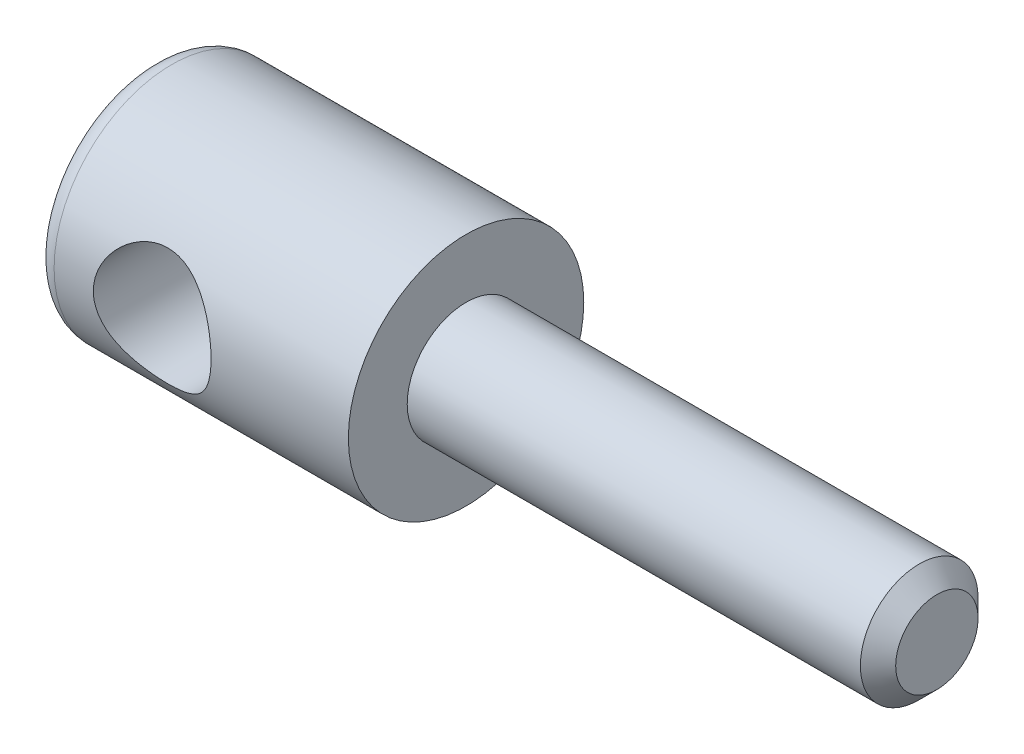
ISO-10303-21;
HEADER;
FILE_DESCRIPTION(('STEP AP214'),'2;1');
FILE_NAME('part.step','',(''),(''),'','','');
FILE_SCHEMA(('AUTOMOTIVE_DESIGN { 1 0 10303 214 1 1 1 1 }'));
ENDSEC;
DATA;
#1=APPLICATION_CONTEXT('core data for automotive mechanical design processes');
#2=APPLICATION_PROTOCOL_DEFINITION('international standard','automotive_design',2000,#1);
#3=PRODUCT_CONTEXT('',#1,'mechanical');
#4=PRODUCT('Part','Part','',(#3));
#5=PRODUCT_RELATED_PRODUCT_CATEGORY('part','',(#4));
#6=PRODUCT_DEFINITION_FORMATION('','',#4);
#7=PRODUCT_DEFINITION_CONTEXT('part definition',#1,'design');
#8=PRODUCT_DEFINITION('design','',#6,#7);
#9=PRODUCT_DEFINITION_SHAPE('','',#8);
#10=(LENGTH_UNIT() NAMED_UNIT(*) SI_UNIT(.MILLI.,.METRE.));
#11=(NAMED_UNIT(*) PLANE_ANGLE_UNIT() SI_UNIT($,.RADIAN.));
#12=(NAMED_UNIT(*) SI_UNIT($,.STERADIAN.) SOLID_ANGLE_UNIT());
#13=UNCERTAINTY_MEASURE_WITH_UNIT(LENGTH_MEASURE(1.E-05),#10,'distance_accuracy_value','');
#14=(GEOMETRIC_REPRESENTATION_CONTEXT(3) GLOBAL_UNCERTAINTY_ASSIGNED_CONTEXT((#13)) GLOBAL_UNIT_ASSIGNED_CONTEXT((#10,
#11,#12)) REPRESENTATION_CONTEXT('',''));
#15=CARTESIAN_POINT('',(0.,0.,0.));
#16=DIRECTION('',(0.,0.,1.));
#17=DIRECTION('',(1.,0.,0.));
#18=AXIS2_PLACEMENT_3D('',#15,#16,#17);
#19=CARTESIAN_POINT('',(0.,0.,0.));
#20=DIRECTION('',(1.,0.,0.));
#21=DIRECTION('',(0.,0.,-1.));
#22=AXIS2_PLACEMENT_3D('',#19,#20,#21);
#23=PLANE('',#22);
#24=CARTESIAN_POINT('',(0.,0.,0.));
#25=DIRECTION('',(1.,0.,0.));
#26=DIRECTION('',(0.,0.,-1.));
#27=AXIS2_PLACEMENT_3D('',#24,#25,#26);
#28=CIRCLE('',#27,7.9375);
#29=CARTESIAN_POINT('',(0.,0.,-7.9375));
#30=VERTEX_POINT('',#29);
#31=EDGE_CURVE('E79',#30,#30,#28,.F.);
#32=ORIENTED_EDGE('',*,*,#31,.T.);
#33=EDGE_LOOP('',(#32));
#34=FACE_BOUND('',#33,.T.);
#35=ADVANCED_FACE('F55',(#34),#23,.F.);
#36=CARTESIAN_POINT('',(0.,0.,0.));
#37=DIRECTION('',(-1.,0.,0.));
#38=DIRECTION('',(0.,0.,1.));
#39=AXIS2_PLACEMENT_3D('',#36,#37,#38);
#40=CYLINDRICAL_SURFACE('',#39,9.525);
#41=CARTESIAN_POINT('',(1.5875,0.,0.));
#42=DIRECTION('',(1.,0.,0.));
#43=DIRECTION('',(0.,0.,-1.));
#44=AXIS2_PLACEMENT_3D('',#41,#42,#43);
#45=CIRCLE('',#44,9.525);
#46=CARTESIAN_POINT('',(1.5875,0.,-9.525));
#47=VERTEX_POINT('',#46);
#48=EDGE_CURVE('E71',#47,#47,#45,.T.);
#49=ORIENTED_EDGE('',*,*,#48,.T.);
#50=EDGE_LOOP('',(#49));
#51=FACE_BOUND('',#50,.T.);
#52=CARTESIAN_POINT('',(14.2875,0.,-9.525));
#53=CARTESIAN_POINT('',(14.2874995883142,0.125243167799988,-9.52499962063721));
#54=CARTESIAN_POINT('',(14.2825538815409,0.250495089131834,-9.52252400598023));
#55=CARTESIAN_POINT('',(14.2628274933583,0.500076393496525,-9.51268396387997));
#56=CARTESIAN_POINT('',(14.2480425334198,0.624405351393144,-9.50531740964972));
#57=CARTESIAN_POINT('',(14.2087846575478,0.871331001268146,-9.48587193787975));
#58=CARTESIAN_POINT('',(14.184297925728,0.993924963523296,-9.47378630044847));
#59=CARTESIAN_POINT('',(14.1259077343834,1.23637011508466,-9.44520637539277));
#60=CARTESIAN_POINT('',(14.0920004252214,1.35622016139572,-9.42871028557932));
#61=CARTESIAN_POINT('',(14.0152959954649,1.59183120722171,-9.3917969722246));
#62=CARTESIAN_POINT('',(13.9725381122571,1.70760770137532,-9.37139708461429));
#63=CARTESIAN_POINT('',(13.8784500200897,1.93495086483045,-9.3271126718355));
#64=CARTESIAN_POINT('',(13.8271165847989,2.04651593025,-9.30322683559748));
#65=CARTESIAN_POINT('',(13.6609458534294,2.37384489745523,-9.22716144615755));
#66=CARTESIAN_POINT('',(13.5338526884547,2.58250225923313,-9.1705315085718));
#67=CARTESIAN_POINT('',(13.2420309696508,2.9885453858336,-9.04666081910159));
#68=CARTESIAN_POINT('',(13.0754907176509,3.18448556312958,-8.9789854011414));
#69=CARTESIAN_POINT('',(12.7134088932679,3.5469969745544,-8.84205954293002));
#70=CARTESIAN_POINT('',(12.5178454279268,3.71354582861883,-8.77280794740667));
#71=CARTESIAN_POINT('',(12.0848674226152,4.02553537328566,-8.63435408613187));
#72=CARTESIAN_POINT('',(11.8453834507436,4.16833749963762,-8.56557212539104));
#73=CARTESIAN_POINT('',(11.4681780616274,4.35029005345507,-8.47379640254792));
#74=CARTESIAN_POINT('',(11.339399825047,4.40557901885786,-8.44509626519091));
#75=CARTESIAN_POINT('',(11.0766213108777,4.50483773649693,-8.39256904955605));
#76=CARTESIAN_POINT('',(10.9426241795386,4.54881419057646,-8.36873908777995));
#77=CARTESIAN_POINT('',(10.6784843907029,4.62261399582858,-8.32818911059645));
#78=CARTESIAN_POINT('',(10.5485845780924,4.65312214328153,-8.31113119648639));
#79=CARTESIAN_POINT('',(10.2861183128582,4.7031837839128,-8.28290506375684));
#80=CARTESIAN_POINT('',(10.1535533138226,4.72274308921002,-8.27173372047613));
#81=CARTESIAN_POINT('',(9.88694274554475,4.75061653464239,-8.25575723957705));
#82=CARTESIAN_POINT('',(9.75289811708642,4.75893744712046,-8.25094826797976));
#83=CARTESIAN_POINT('',(9.48451818068096,4.76421854927812,-8.24790017307781));
#84=CARTESIAN_POINT('',(9.35018290168949,4.76117982286953,-8.24966042295242));
#85=CARTESIAN_POINT('',(9.0985605369466,4.74483797280581,-8.25906842780932));
#86=CARTESIAN_POINT('',(8.98116126726877,4.73280973448218,-8.26598467895691));
#87=CARTESIAN_POINT('',(8.74793667425509,4.7001560114978,-8.28459407928507));
#88=CARTESIAN_POINT('',(8.63211185707073,4.67952782662532,-8.29628872876443));
#89=CARTESIAN_POINT('',(8.28820359489727,4.60506661909891,-8.33800444414718));
#90=CARTESIAN_POINT('',(8.06351322141476,4.5386452957775,-8.374664603912));
#91=CARTESIAN_POINT('',(7.62363577254265,4.37297035741612,-8.46236620531705));
#92=CARTESIAN_POINT('',(7.40879196497443,4.27298801966146,-8.51372273880605));
#93=CARTESIAN_POINT('',(6.99786249608706,4.04355977442936,-8.62505005190895));
#94=CARTESIAN_POINT('',(6.80178531682722,3.91410063264098,-8.68502469635285));
#95=CARTESIAN_POINT('',(6.40784506896536,3.61029947812718,-8.8160120789406));
#96=CARTESIAN_POINT('',(6.21290797985575,3.43234782914613,-8.88746017331489));
#97=CARTESIAN_POINT('',(5.85435121852992,3.0458429533087,-9.02721381532402));
#98=CARTESIAN_POINT('',(5.69074651343944,2.83727518509305,-9.0955178493011));
#99=CARTESIAN_POINT('',(5.46883467336284,2.49965137796343,-9.19195370403877));
#100=CARTESIAN_POINT('',(5.39748202968255,2.38002127368373,-9.22372787983904));
#101=CARTESIAN_POINT('',(5.26522178631797,2.13427687141611,-9.28366556941998));
#102=CARTESIAN_POINT('',(5.20430978353974,2.00816533613017,-9.31183060399966));
#103=CARTESIAN_POINT('',(5.0935900445178,1.75034069526615,-9.36371844925579));
#104=CARTESIAN_POINT('',(5.04377783818485,1.61862987016266,-9.38744304755807));
#105=CARTESIAN_POINT('',(4.95583376217831,1.35056106639509,-9.42974072645534));
#106=CARTESIAN_POINT('',(4.91770054882685,1.21420362433566,-9.4483143996453));
#107=CARTESIAN_POINT('',(4.85628927908233,0.949450109300049,-9.47841891468132));
#108=CARTESIAN_POINT('',(4.83204248612878,0.821329961906903,-9.49040564136937));
#109=CARTESIAN_POINT('',(4.79411534118489,0.563164063018348,-9.50921741531495));
#110=CARTESIAN_POINT('',(4.78043405513058,0.43311848278076,-9.51604291885924));
#111=CARTESIAN_POINT('',(4.76382096304198,0.172222200636558,-9.52433687415141));
#112=CARTESIAN_POINT('',(4.76088504167854,0.0413718261918284,-9.52580737679104));
#113=CARTESIAN_POINT('',(4.76579143418984,-0.220072847166308,-9.52335444060485));
#114=CARTESIAN_POINT('',(4.77363327106403,-0.350667157156418,-9.5194312404928));
#115=CARTESIAN_POINT('',(4.79896043682593,-0.600383632816324,-9.50681651861088));
#116=CARTESIAN_POINT('',(4.81564795465565,-0.71960779805965,-9.49851975936574));
#117=CARTESIAN_POINT('',(4.85791618607807,-0.956123558476324,-9.47763434053446));
#118=CARTESIAN_POINT('',(4.88349971649687,-1.07341452918894,-9.46504432155854));
#119=CARTESIAN_POINT('',(4.94328705590225,-1.30523272581463,-9.43586934009923));
#120=CARTESIAN_POINT('',(4.97748822700577,-1.41976078572846,-9.41928560017321));
#121=CARTESIAN_POINT('',(5.05418232366048,-1.64542419391326,-9.38249998161801));
#122=CARTESIAN_POINT('',(5.09667842551347,-1.75655822362735,-9.36229671724176));
#123=CARTESIAN_POINT('',(5.23870028602481,-2.09007412634844,-9.29566539786795));
#124=CARTESIAN_POINT('',(5.35108855655026,-2.3061103310862,-9.24405921515466));
#125=CARTESIAN_POINT('',(5.6059884640418,-2.7168591855057,-9.13180205397676));
#126=CARTESIAN_POINT('',(5.74851293334769,-2.91156269769227,-9.07114722574502));
#127=CARTESIAN_POINT('',(6.07579489471238,-3.29452731372961,-8.93960783885979));
#128=CARTESIAN_POINT('',(6.2633252861442,-3.48027815582498,-8.868303631423));
#129=CARTESIAN_POINT('',(6.6671861866201,-3.81886460963264,-8.72786114875584));
#130=CARTESIAN_POINT('',(6.88353645260841,-3.97167745144758,-8.65872439991558));
#131=CARTESIAN_POINT('',(7.23184726433337,-4.17638881115548,-8.56092960704944));
#132=CARTESIAN_POINT('',(7.35506295800266,-4.24173741059431,-8.52864647367418));
#133=CARTESIAN_POINT('',(7.60751663099197,-4.36167001930206,-8.46793790675363));
#134=CARTESIAN_POINT('',(7.73675184965807,-4.41625890421415,-8.43951072775552));
#135=CARTESIAN_POINT('',(8.00031137614729,-4.5140308411884,-8.38762286815761));
#136=CARTESIAN_POINT('',(8.13463142160192,-4.55722321448887,-8.3641581318998));
#137=CARTESIAN_POINT('',(8.40742321829064,-4.63167416627274,-8.32316235190996));
#138=CARTESIAN_POINT('',(8.54589432311324,-4.66293459251873,-8.30563038948563));
#139=CARTESIAN_POINT('',(8.81230614491235,-4.71062527640278,-8.27866590076996));
#140=CARTESIAN_POINT('',(8.93998200867176,-4.72819092555356,-8.26861751501086));
#141=CARTESIAN_POINT('',(9.19665919652676,-4.75291664228841,-8.25443000373948));
#142=CARTESIAN_POINT('',(9.32566038032394,-4.76007780009145,-8.25029025909994));
#143=CARTESIAN_POINT('',(9.58382347106691,-4.7638856717754,-8.24809207938037));
#144=CARTESIAN_POINT('',(9.71298530555926,-4.76053608147037,-8.25003150672728));
#145=CARTESIAN_POINT('',(9.97037524394535,-4.74338307929258,-8.2599055190099));
#146=CARTESIAN_POINT('',(10.0986033858471,-4.72958009537705,-8.2678398585166));
#147=CARTESIAN_POINT('',(10.3408735925565,-4.69353669139922,-8.28834856879424));
#148=CARTESIAN_POINT('',(10.4550996380418,-4.67222934629288,-8.30040666790683));
#149=CARTESIAN_POINT('',(10.6812027840155,-4.62147643847891,-8.32877048505192));
#150=CARTESIAN_POINT('',(10.7930791465907,-4.59202835912458,-8.34507751652015));
#151=CARTESIAN_POINT('',(11.124168552145,-4.49189766535446,-8.3996615585496));
#152=CARTESIAN_POINT('',(11.3389944304742,-4.40940547807408,-8.44361545117001));
#153=CARTESIAN_POINT('',(11.7663852260527,-4.20916574352957,-8.54528603634262));
#154=CARTESIAN_POINT('',(11.9778285423799,-4.08942191082135,-8.60372898549138));
#155=CARTESIAN_POINT('',(12.3790368143899,-3.82024338512734,-8.72658246261697));
#156=CARTESIAN_POINT('',(12.5687904104806,-3.67079324521364,-8.79099608593485));
#157=CARTESIAN_POINT('',(12.9451492351934,-3.32520368388596,-8.92789150982252));
#158=CARTESIAN_POINT('',(13.1285704078762,-3.12559766366325,-9.00040265167881));
#159=CARTESIAN_POINT('',(13.4600960361771,-2.69626914168462,-9.13818513010388));
#160=CARTESIAN_POINT('',(13.6081814555507,-2.4665305095516,-9.20345255422176));
#161=CARTESIAN_POINT('',(13.8004204698368,-2.10268072495818,-9.29086610240478));
#162=CARTESIAN_POINT('',(13.8597008931346,-1.97763300723182,-9.31834760006229));
#163=CARTESIAN_POINT('',(13.9673991887047,-1.72211552262133,-9.36893044835914));
#164=CARTESIAN_POINT('',(14.0158223974304,-1.59164845695406,-9.39203394996841));
#165=CARTESIAN_POINT('',(14.1011390300447,-1.32654199767925,-9.43312646132604));
#166=CARTESIAN_POINT('',(14.1380576010708,-1.19191242135595,-9.45112661821365));
#167=CARTESIAN_POINT('',(14.2000010604458,-0.919388438520267,-9.48151473751691));
#168=CARTESIAN_POINT('',(14.225033214082,-0.781496080561073,-9.49390612793916));
#169=CARTESIAN_POINT('',(14.2584244917289,-0.53629717582377,-9.5104875945448));
#170=CARTESIAN_POINT('',(14.2693184453916,-0.429411583767847,-9.51592021375587));
#171=CARTESIAN_POINT('',(14.2838564762833,-0.215019489362877,-9.52317662911679));
#172=CARTESIAN_POINT('',(14.287500353405,-0.107512969957933,-9.52500032565785));
#173=CARTESIAN_POINT('',(14.2875,0.,-9.525));
#174=B_SPLINE_CURVE_WITH_KNOTS('',3,(#52,#53,#54,#55,#56,#57,#58,#59,#60,#61,#62,#63,#64,#65,
#66,#67,#68,#69,#70,#71,#72,#73,#74,#75,#76,#77,#78,#79,#80,#81,#82,#83,#84,#85,#86,#87,#88,#89,
#90,#91,#92,#93,#94,#95,#96,#97,#98,#99,#100,#101,#102,#103,#104,#105,#106,#107,#108,#109,#110,
#111,#112,#113,#114,#115,#116,#117,#118,#119,#120,#121,#122,#123,#124,#125,#126,#127,#128,#129,
#130,#131,#132,#133,#134,#135,#136,#137,#138,#139,#140,#141,#142,#143,#144,#145,#146,#147,#148,
#149,#150,#151,#152,#153,#154,#155,#156,#157,#158,#159,#160,#161,#162,#163,#164,#165,#166,#167,
#168,#169,#170,#171,#172,#173),.UNSPECIFIED.,.T.,.F.,(4,2,2,2,2,2,2,2,2,2,2,2,2,2,2,2,2,2,2,2,2,
2,2,2,2,2,2,2,2,2,2,2,2,2,2,2,2,2,2,2,2,2,2,2,2,2,2,2,2,2,2,2,2,2,2,2,2,2,2,2,4),(0.,
0.375623418154019,0.75141028029602,1.12773421934005,1.50421216665562,1.87905550525341,
2.25404018794786,3.00318908218551,3.79765979831069,4.59273287924313,5.44946389368038,
5.87811905389959,6.30651967909287,6.70950847539314,7.11228314445236,7.51481498990844,
7.91730842763878,8.27152461989832,8.62585211283933,9.33399259637594,10.0586277474397,
10.7835888844336,11.6004728904415,12.4177461446779,12.8458801890468,13.2738332313566,
13.701613616489,14.1293447666274,14.5216515243149,14.9139235953969,15.3060454158578,
15.6981498824039,16.0597456619957,16.4214560413944,16.7830558344936,17.144794364286,
17.8882174899416,18.6319578135025,19.4487341785404,20.2660733794108,20.6950689367829,
21.1238696504805,21.5523185520335,21.9807010777177,22.3679690015926,22.7551963432537,
23.142287542382,23.5293628950278,23.8794231642633,24.2295917732494,24.9294696536928,
25.6763690993088,26.423657944613,27.2617475314396,28.1002876036313,28.5230685284024,
28.9456411934233,29.3672836019069,29.7886679587935,30.111106902089,30.4335547448008),.UNSPECIFIED.);
#175=CARTESIAN_POINT('',(14.2875,0.,-9.525));
#176=VERTEX_POINT('',#175);
#177=EDGE_CURVE('E85',#176,#176,#174,.T.);
#178=ORIENTED_EDGE('',*,*,#177,.T.);
#179=EDGE_LOOP('',(#178));
#180=FACE_BOUND('',#179,.T.);
#181=CARTESIAN_POINT('',(14.2875,0.,9.525));
#182=CARTESIAN_POINT('',(14.2874995883142,-0.125243167799989,9.5249996206372));
#183=CARTESIAN_POINT('',(14.2825538815409,-0.250495089131835,9.52252400598023));
#184=CARTESIAN_POINT('',(14.2628274933583,-0.500076393496525,9.51268396387997));
#185=CARTESIAN_POINT('',(14.2480425334198,-0.624405351393145,9.50531740964972));
#186=CARTESIAN_POINT('',(14.2087846575478,-0.871331001268147,9.48587193787975));
#187=CARTESIAN_POINT('',(14.184297925728,-0.993924963523296,9.47378630044848));
#188=CARTESIAN_POINT('',(14.1259077343834,-1.23637011508467,9.44520637539277));
#189=CARTESIAN_POINT('',(14.0920004252214,-1.35622016139572,9.42871028557932));
#190=CARTESIAN_POINT('',(14.0152959954649,-1.59183120722171,9.39179697222459));
#191=CARTESIAN_POINT('',(13.9725381122571,-1.70760770137532,9.37139708461428));
#192=CARTESIAN_POINT('',(13.8784500200897,-1.93495086483045,9.32711267183551));
#193=CARTESIAN_POINT('',(13.8271165847989,-2.04651593025,9.30322683559748));
#194=CARTESIAN_POINT('',(13.6609458534294,-2.37384489745523,9.22716144615755));
#195=CARTESIAN_POINT('',(13.5338526884547,-2.58250225923313,9.1705315085718));
#196=CARTESIAN_POINT('',(13.2420309696508,-2.9885453858336,9.04666081910159));
#197=CARTESIAN_POINT('',(13.0754907176509,-3.18448556312958,8.9789854011414));
#198=CARTESIAN_POINT('',(12.7134088932679,-3.5469969745544,8.84205954293002));
#199=CARTESIAN_POINT('',(12.5178454279268,-3.71354582861883,8.77280794740667));
#200=CARTESIAN_POINT('',(12.0848674226152,-4.02553537328567,8.63435408613187));
#201=CARTESIAN_POINT('',(11.8453834507436,-4.16833749963762,8.56557212539104));
#202=CARTESIAN_POINT('',(11.4681780616274,-4.35029005345507,8.47379640254792));
#203=CARTESIAN_POINT('',(11.339399825047,-4.40557901885786,8.44509626519091));
#204=CARTESIAN_POINT('',(11.0766213108777,-4.50483773649693,8.39256904955605));
#205=CARTESIAN_POINT('',(10.9426241795386,-4.54881419057646,8.36873908777995));
#206=CARTESIAN_POINT('',(10.6784843907029,-4.62261399582858,8.32818911059646));
#207=CARTESIAN_POINT('',(10.5485845780924,-4.65312214328153,8.31113119648639));
#208=CARTESIAN_POINT('',(10.2861183128582,-4.7031837839128,8.28290506375684));
#209=CARTESIAN_POINT('',(10.1535533138226,-4.72274308921002,8.27173372047613));
#210=CARTESIAN_POINT('',(9.88694274554475,-4.75061653464239,8.25575723957705));
#211=CARTESIAN_POINT('',(9.75289811708642,-4.75893744712046,8.25094826797976));
#212=CARTESIAN_POINT('',(9.48451818068096,-4.76421854927812,8.24790017307781));
#213=CARTESIAN_POINT('',(9.35018290168949,-4.76117982286953,8.24966042295242));
#214=CARTESIAN_POINT('',(9.0985605369466,-4.74483797280581,8.25906842780931));
#215=CARTESIAN_POINT('',(8.98116126726877,-4.73280973448218,8.26598467895691));
#216=CARTESIAN_POINT('',(8.74793667425509,-4.7001560114978,8.28459407928507));
#217=CARTESIAN_POINT('',(8.63211185707073,-4.67952782662532,8.29628872876443));
#218=CARTESIAN_POINT('',(8.28820359489727,-4.60506661909891,8.33800444414718));
#219=CARTESIAN_POINT('',(8.06351322141475,-4.5386452957775,8.374664603912));
#220=CARTESIAN_POINT('',(7.62363577254265,-4.37297035741612,8.46236620531705));
#221=CARTESIAN_POINT('',(7.40879196497443,-4.27298801966146,8.51372273880605));
#222=CARTESIAN_POINT('',(6.99786249608706,-4.04355977442936,8.62505005190895));
#223=CARTESIAN_POINT('',(6.80178531682722,-3.91410063264098,8.68502469635285));
#224=CARTESIAN_POINT('',(6.40784506896536,-3.61029947812718,8.8160120789406));
#225=CARTESIAN_POINT('',(6.21290797985575,-3.43234782914613,8.88746017331489));
#226=CARTESIAN_POINT('',(5.85435121852992,-3.0458429533087,9.02721381532402));
#227=CARTESIAN_POINT('',(5.69074651343944,-2.83727518509305,9.0955178493011));
#228=CARTESIAN_POINT('',(5.46883467336283,-2.49965137796343,9.19195370403877));
#229=CARTESIAN_POINT('',(5.39748202968255,-2.38002127368372,9.22372787983904));
#230=CARTESIAN_POINT('',(5.26522178631797,-2.13427687141611,9.28366556941998));
#231=CARTESIAN_POINT('',(5.20430978353974,-2.00816533613017,9.31183060399966));
#232=CARTESIAN_POINT('',(5.09359004451779,-1.75034069526615,9.36371844925579));
#233=CARTESIAN_POINT('',(5.04377783818485,-1.61862987016266,9.38744304755807));
#234=CARTESIAN_POINT('',(4.95583376217831,-1.35056106639509,9.42974072645534));
#235=CARTESIAN_POINT('',(4.91770054882685,-1.21420362433566,9.4483143996453));
#236=CARTESIAN_POINT('',(4.85628927908233,-0.949450109300047,9.47841891468132));
#237=CARTESIAN_POINT('',(4.83204248612878,-0.8213299619069,9.49040564136937));
#238=CARTESIAN_POINT('',(4.79411534118489,-0.563164063018345,9.50921741531495));
#239=CARTESIAN_POINT('',(4.78043405513058,-0.433118482780757,9.51604291885924));
#240=CARTESIAN_POINT('',(4.76382096304198,-0.172222200636556,9.52433687415141));
#241=CARTESIAN_POINT('',(4.76088504167854,-0.0413718261918268,9.52580737679104));
#242=CARTESIAN_POINT('',(4.76579143418984,0.220072847166309,9.52335444060485));
#243=CARTESIAN_POINT('',(4.77363327106403,0.350667157156419,9.5194312404928));
#244=CARTESIAN_POINT('',(4.79896043682593,0.600383632816325,9.50681651861088));
#245=CARTESIAN_POINT('',(4.81564795465565,0.719607798059651,9.49851975936574));
#246=CARTESIAN_POINT('',(4.85791618607807,0.956123558476325,9.47763434053446));
#247=CARTESIAN_POINT('',(4.88349971649687,1.07341452918894,9.46504432155854));
#248=CARTESIAN_POINT('',(4.94328705590225,1.30523272581463,9.43586934009923));
#249=CARTESIAN_POINT('',(4.97748822700577,1.41976078572846,9.41928560017321));
#250=CARTESIAN_POINT('',(5.05418232366048,1.64542419391326,9.38249998161801));
#251=CARTESIAN_POINT('',(5.09667842551347,1.75655822362735,9.36229671724176));
#252=CARTESIAN_POINT('',(5.2387002860248,2.09007412634844,9.29566539786795));
#253=CARTESIAN_POINT('',(5.35108855655026,2.3061103310862,9.24405921515466));
#254=CARTESIAN_POINT('',(5.6059884640418,2.7168591855057,9.13180205397676));
#255=CARTESIAN_POINT('',(5.74851293334769,2.91156269769227,9.07114722574502));
#256=CARTESIAN_POINT('',(6.07579489471238,3.29452731372962,8.93960783885979));
#257=CARTESIAN_POINT('',(6.2633252861442,3.48027815582498,8.868303631423));
#258=CARTESIAN_POINT('',(6.6671861866201,3.81886460963264,8.72786114875584));
#259=CARTESIAN_POINT('',(6.88353645260841,3.97167745144758,8.65872439991558));
#260=CARTESIAN_POINT('',(7.23184726433337,4.17638881115548,8.56092960704944));
#261=CARTESIAN_POINT('',(7.35506295800266,4.24173741059431,8.52864647367418));
#262=CARTESIAN_POINT('',(7.60751663099197,4.36167001930206,8.46793790675363));
#263=CARTESIAN_POINT('',(7.73675184965807,4.41625890421415,8.43951072775552));
#264=CARTESIAN_POINT('',(8.00031137614729,4.51403084118841,8.38762286815761));
#265=CARTESIAN_POINT('',(8.13463142160192,4.55722321448887,8.36415813189979));
#266=CARTESIAN_POINT('',(8.40742321829064,4.63167416627274,8.32316235190995));
#267=CARTESIAN_POINT('',(8.54589432311324,4.66293459251873,8.30563038948563));
#268=CARTESIAN_POINT('',(8.81230614491236,4.71062527640277,8.27866590076996));
#269=CARTESIAN_POINT('',(8.93998200867176,4.72819092555356,8.26861751501086));
#270=CARTESIAN_POINT('',(9.19665919652676,4.75291664228841,8.25443000373948));
#271=CARTESIAN_POINT('',(9.32566038032394,4.76007780009145,8.25029025909994));
#272=CARTESIAN_POINT('',(9.58382347106691,4.7638856717754,8.24809207938037));
#273=CARTESIAN_POINT('',(9.71298530555926,4.76053608147037,8.25003150672728));
#274=CARTESIAN_POINT('',(9.97037524394535,4.74338307929258,8.2599055190099));
#275=CARTESIAN_POINT('',(10.0986033858471,4.72958009537705,8.2678398585166));
#276=CARTESIAN_POINT('',(10.3408735925565,4.69353669139922,8.28834856879424));
#277=CARTESIAN_POINT('',(10.4550996380418,4.67222934629288,8.30040666790683));
#278=CARTESIAN_POINT('',(10.6812027840155,4.62147643847891,8.32877048505192));
#279=CARTESIAN_POINT('',(10.7930791465907,4.59202835912458,8.34507751652015));
#280=CARTESIAN_POINT('',(11.124168552145,4.49189766535446,8.3996615585496));
#281=CARTESIAN_POINT('',(11.3389944304742,4.40940547807408,8.44361545117001));
#282=CARTESIAN_POINT('',(11.7663852260527,4.20916574352957,8.54528603634262));
#283=CARTESIAN_POINT('',(11.9778285423799,4.08942191082134,8.60372898549138));
#284=CARTESIAN_POINT('',(12.3790368143899,3.82024338512734,8.72658246261697));
#285=CARTESIAN_POINT('',(12.5687904104806,3.67079324521364,8.79099608593485));
#286=CARTESIAN_POINT('',(12.9451492351934,3.32520368388596,8.92789150982252));
#287=CARTESIAN_POINT('',(13.1285704078762,3.12559766366325,9.00040265167881));
#288=CARTESIAN_POINT('',(13.4600960361771,2.69626914168462,9.13818513010388));
#289=CARTESIAN_POINT('',(13.6081814555508,2.46653050955159,9.20345255422176));
#290=CARTESIAN_POINT('',(13.8004204698368,2.10268072495818,9.29086610240478));
#291=CARTESIAN_POINT('',(13.8597008931346,1.97763300723182,9.3183476000623));
#292=CARTESIAN_POINT('',(13.9673991887047,1.72211552262133,9.36893044835914));
#293=CARTESIAN_POINT('',(14.0158223974304,1.59164845695406,9.39203394996841));
#294=CARTESIAN_POINT('',(14.1011390300447,1.32654199767925,9.43312646132604));
#295=CARTESIAN_POINT('',(14.1380576010708,1.19191242135594,9.45112661821365));
#296=CARTESIAN_POINT('',(14.2000010604458,0.919388438520263,9.48151473751691));
#297=CARTESIAN_POINT('',(14.225033214082,0.781496080561071,9.49390612793916));
#298=CARTESIAN_POINT('',(14.2584244917289,0.536297175823769,9.5104875945448));
#299=CARTESIAN_POINT('',(14.2693184453916,0.429411583767846,9.51592021375587));
#300=CARTESIAN_POINT('',(14.2838564762833,0.215019489362876,9.52317662911679));
#301=CARTESIAN_POINT('',(14.287500353405,0.107512969957933,9.52500032565785));
#302=CARTESIAN_POINT('',(14.2875,0.,9.525));
#303=B_SPLINE_CURVE_WITH_KNOTS('',3,(#181,#182,#183,#184,#185,#186,#187,#188,#189,#190,#191,
#192,#193,#194,#195,#196,#197,#198,#199,#200,#201,#202,#203,#204,#205,#206,#207,#208,#209,#210,
#211,#212,#213,#214,#215,#216,#217,#218,#219,#220,#221,#222,#223,#224,#225,#226,#227,#228,#229,
#230,#231,#232,#233,#234,#235,#236,#237,#238,#239,#240,#241,#242,#243,#244,#245,#246,#247,#248,
#249,#250,#251,#252,#253,#254,#255,#256,#257,#258,#259,#260,#261,#262,#263,#264,#265,#266,#267,
#268,#269,#270,#271,#272,#273,#274,#275,#276,#277,#278,#279,#280,#281,#282,#283,#284,#285,#286,
#287,#288,#289,#290,#291,#292,#293,#294,#295,#296,#297,#298,#299,#300,#301,#302),.UNSPECIFIED.,
.T.,.F.,(4,2,2,2,2,2,2,2,2,2,2,2,2,2,2,2,2,2,2,2,2,2,2,2,2,2,2,2,2,2,2,2,2,2,2,2,2,2,2,2,2,2,2,
2,2,2,2,2,2,2,2,2,2,2,2,2,2,2,2,2,4),(0.,0.37562341815402,0.751410280296021,1.12773421934005,
1.50421216665562,1.87905550525341,2.25404018794786,3.00318908218551,3.79765979831069,
4.59273287924313,5.44946389368039,5.87811905389959,6.30651967909288,6.70950847539314,
7.11228314445236,7.51481498990844,7.91730842763878,8.27152461989832,8.62585211283933,
9.33399259637594,10.0586277474397,10.7835888844336,11.6004728904415,12.4177461446779,
12.8458801890468,13.2738332313566,13.701613616489,14.1293447666274,14.5216515243149,
14.9139235953969,15.3060454158578,15.6981498824039,16.0597456619957,16.4214560413944,
16.7830558344936,17.144794364286,17.8882174899416,18.6319578135025,19.4487341785404,
20.2660733794108,20.6950689367829,21.1238696504805,21.5523185520335,21.9807010777177,
22.3679690015926,22.7551963432537,23.142287542382,23.5293628950278,23.8794231642633,
24.2295917732494,24.9294696536928,25.6763690993088,26.423657944613,27.2617475314396,
28.1002876036313,28.5230685284024,28.9456411934233,29.3672836019069,29.7886679587935,
30.111106902089,30.4335547448008),.UNSPECIFIED.);
#304=CARTESIAN_POINT('',(14.2875,0.,9.525));
#305=VERTEX_POINT('',#304);
#306=EDGE_CURVE('E94',#305,#305,#303,.T.);
#307=ORIENTED_EDGE('',*,*,#306,.T.);
#308=EDGE_LOOP('',(#307));
#309=FACE_BOUND('',#308,.T.);
#310=CARTESIAN_POINT('',(25.4,0.,0.));
#311=DIRECTION('',(-1.,0.,0.));
#312=DIRECTION('',(0.,0.,1.));
#313=AXIS2_PLACEMENT_3D('',#310,#311,#312);
#314=CIRCLE('',#313,9.525);
#315=CARTESIAN_POINT('',(25.4,0.,9.525));
#316=VERTEX_POINT('',#315);
#317=EDGE_CURVE('E141',#316,#316,#314,.T.);
#318=ORIENTED_EDGE('',*,*,#317,.T.);
#319=EDGE_LOOP('',(#318));
#320=FACE_BOUND('',#319,.T.);
#321=ADVANCED_FACE('F99',(#51,#180,#309,#320),#40,.T.);
#322=CARTESIAN_POINT('',(25.4,9.525,0.));
#323=DIRECTION('',(-1.,0.,0.));
#324=DIRECTION('',(0.,0.,1.));
#325=AXIS2_PLACEMENT_3D('',#322,#323,#324);
#326=PLANE('',#325);
#327=ORIENTED_EDGE('',*,*,#317,.F.);
#328=EDGE_LOOP('',(#327));
#329=FACE_BOUND('',#328,.T.);
#330=CARTESIAN_POINT('',(25.4,0.,0.));
#331=DIRECTION('',(-1.,0.,0.));
#332=DIRECTION('',(0.,0.,1.));
#333=AXIS2_PLACEMENT_3D('',#330,#331,#332);
#334=CIRCLE('',#333,4.7625);
#335=CARTESIAN_POINT('',(25.4,0.,4.7625));
#336=VERTEX_POINT('',#335);
#337=EDGE_CURVE('E142',#336,#336,#334,.T.);
#338=ORIENTED_EDGE('',*,*,#337,.T.);
#339=EDGE_LOOP('',(#338));
#340=FACE_BOUND('',#339,.T.);
#341=ADVANCED_FACE('F115',(#329,#340),#326,.F.);
#342=CARTESIAN_POINT('',(0.,0.,0.));
#343=DIRECTION('',(-1.,0.,0.));
#344=DIRECTION('',(0.,0.,1.));
#345=AXIS2_PLACEMENT_3D('',#342,#343,#344);
#346=CYLINDRICAL_SURFACE('',#345,4.7625);
#347=CARTESIAN_POINT('',(62.07125,0.,0.));
#348=DIRECTION('',(-1.,0.,0.));
#349=DIRECTION('',(0.,0.,1.));
#350=AXIS2_PLACEMENT_3D('',#347,#348,#349);
#351=CIRCLE('',#350,4.7625);
#352=CARTESIAN_POINT('',(62.07125,0.,4.7625));
#353=VERTEX_POINT('',#352);
#354=EDGE_CURVE('E64',#353,#353,#351,.T.);
#355=ORIENTED_EDGE('',*,*,#354,.T.);
#356=EDGE_LOOP('',(#355));
#357=FACE_BOUND('',#356,.T.);
#358=ORIENTED_EDGE('',*,*,#337,.F.);
#359=EDGE_LOOP('',(#358));
#360=FACE_BOUND('',#359,.T.);
#361=ADVANCED_FACE('F113',(#357,#360),#346,.T.);
#362=CARTESIAN_POINT('',(63.5,4.7625,0.));
#363=DIRECTION('',(-1.,0.,0.));
#364=DIRECTION('',(0.,0.,1.));
#365=AXIS2_PLACEMENT_3D('',#362,#363,#364);
#366=PLANE('',#365);
#367=CARTESIAN_POINT('',(63.5,0.,0.));
#368=DIRECTION('',(-1.,0.,0.));
#369=DIRECTION('',(0.,0.,1.));
#370=AXIS2_PLACEMENT_3D('',#367,#368,#369);
#371=CIRCLE('',#370,3.33375);
#372=CARTESIAN_POINT('',(63.5,0.,3.33375));
#373=VERTEX_POINT('',#372);
#374=EDGE_CURVE('E10',#373,#373,#371,.F.);
#375=ORIENTED_EDGE('',*,*,#374,.T.);
#376=EDGE_LOOP('',(#375));
#377=FACE_BOUND('',#376,.T.);
#378=ADVANCED_FACE('F108',(#377),#366,.F.);
#379=CARTESIAN_POINT('',(9.525,0.,9.525));
#380=DIRECTION('',(0.,0.,1.));
#381=DIRECTION('',(1.,0.,0.));
#382=AXIS2_PLACEMENT_3D('',#379,#380,#381);
#383=CYLINDRICAL_SURFACE('',#382,4.7625);
#384=ORIENTED_EDGE('',*,*,#306,.F.);
#385=EDGE_LOOP('',(#384));
#386=FACE_BOUND('',#385,.T.);
#387=ORIENTED_EDGE('',*,*,#177,.F.);
#388=EDGE_LOOP('',(#387));
#389=FACE_BOUND('',#388,.T.);
#390=ADVANCED_FACE('F103',(#386,#389),#383,.F.);
#391=CARTESIAN_POINT('',(1.5875,0.,0.));
#392=DIRECTION('',(1.,0.,0.));
#393=DIRECTION('',(0.,0.,-1.));
#394=AXIS2_PLACEMENT_3D('',#391,#392,#393);
#395=TOROIDAL_SURFACE('',#394,7.9375,1.5875);
#396=ORIENTED_EDGE('',*,*,#48,.F.);
#397=EDGE_LOOP('',(#396));
#398=FACE_BOUND('',#397,.T.);
#399=ORIENTED_EDGE('',*,*,#31,.F.);
#400=EDGE_LOOP('',(#399));
#401=FACE_BOUND('',#400,.T.);
#402=ADVANCED_FACE('F107',(#398,#401),#395,.T.);
#403=CARTESIAN_POINT('',(62.07125,0.,0.));
#404=DIRECTION('',(-1.,0.,0.));
#405=DIRECTION('',(0.,0.,1.));
#406=AXIS2_PLACEMENT_3D('',#403,#404,#405);
#407=CONICAL_SURFACE('',#406,4.7625,0.785398163397447);
#408=ORIENTED_EDGE('',*,*,#374,.F.);
#409=EDGE_LOOP('',(#408));
#410=FACE_BOUND('',#409,.T.);
#411=ORIENTED_EDGE('',*,*,#354,.F.);
#412=EDGE_LOOP('',(#411));
#413=FACE_BOUND('',#412,.T.);
#414=ADVANCED_FACE('F58',(#410,#413),#407,.T.);
#415=CLOSED_SHELL('',(#35,#321,#341,#361,#378,#390,#402,#414));
#416=MANIFOLD_SOLID_BREP('B2',#415);
#417=ADVANCED_BREP_SHAPE_REPRESENTATION('',(#18,#416),#14);
#418=SHAPE_DEFINITION_REPRESENTATION(#9,#417);
ENDSEC;
END-ISO-10303-21;
